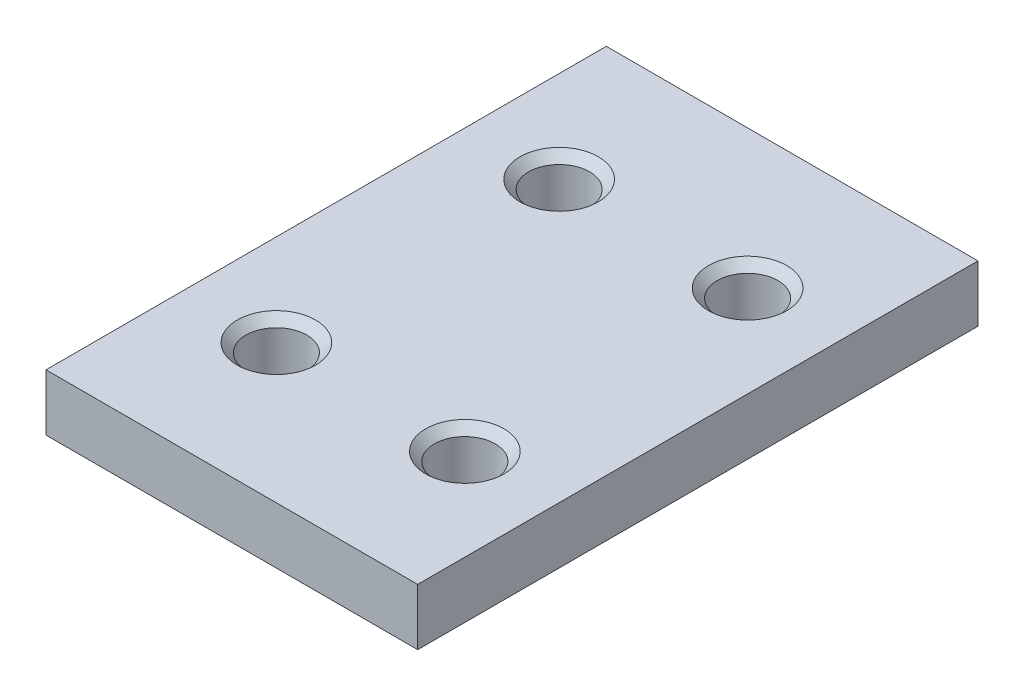
ISO-10303-21;
HEADER;
FILE_DESCRIPTION(('STEP AP214'),'2;1');
FILE_NAME('part.step','',(''),(''),'','','');
FILE_SCHEMA(('AUTOMOTIVE_DESIGN { 1 0 10303 214 1 1 1 1 }'));
ENDSEC;
DATA;
#1=APPLICATION_CONTEXT('core data for automotive mechanical design processes');
#2=APPLICATION_PROTOCOL_DEFINITION('international standard','automotive_design',2000,#1);
#3=PRODUCT_CONTEXT('',#1,'mechanical');
#4=PRODUCT('Part','Part','',(#3));
#5=PRODUCT_RELATED_PRODUCT_CATEGORY('part','',(#4));
#6=PRODUCT_DEFINITION_FORMATION('','',#4);
#7=PRODUCT_DEFINITION_CONTEXT('part definition',#1,'design');
#8=PRODUCT_DEFINITION('design','',#6,#7);
#9=PRODUCT_DEFINITION_SHAPE('','',#8);
#10=(LENGTH_UNIT() NAMED_UNIT(*) SI_UNIT(.MILLI.,.METRE.));
#11=(NAMED_UNIT(*) PLANE_ANGLE_UNIT() SI_UNIT($,.RADIAN.));
#12=(NAMED_UNIT(*) SI_UNIT($,.STERADIAN.) SOLID_ANGLE_UNIT());
#13=UNCERTAINTY_MEASURE_WITH_UNIT(LENGTH_MEASURE(1.E-05),#10,'distance_accuracy_value','');
#14=(GEOMETRIC_REPRESENTATION_CONTEXT(3) GLOBAL_UNCERTAINTY_ASSIGNED_CONTEXT((#13)) GLOBAL_UNIT_ASSIGNED_CONTEXT((#10,
#11,#12)) REPRESENTATION_CONTEXT('',''));
#15=CARTESIAN_POINT('',(0.,0.,0.));
#16=DIRECTION('',(0.,0.,1.));
#17=DIRECTION('',(1.,0.,0.));
#18=AXIS2_PLACEMENT_3D('',#15,#16,#17);
#19=CARTESIAN_POINT('',(0.,6.5,0.));
#20=DIRECTION('',(0.,-1.,0.));
#21=DIRECTION('',(0.,0.,-1.));
#22=AXIS2_PLACEMENT_3D('',#19,#20,#21);
#23=PLANE('',#22);
#24=CARTESIAN_POINT('',(-10.530066675,6.5,48.45));
#25=DIRECTION('',(0.,-1.,0.));
#26=DIRECTION('',(0.,0.,-1.));
#27=AXIS2_PLACEMENT_3D('',#24,#25,#26);
#28=CIRCLE('',#27,4.50000000000004);
#29=CARTESIAN_POINT('',(-10.530066675,6.5,43.95));
#30=VERTEX_POINT('',#29);
#31=EDGE_CURVE('E161',#30,#30,#28,.T.);
#32=ORIENTED_EDGE('',*,*,#31,.T.);
#33=EDGE_LOOP('',(#32));
#34=FACE_BOUND('',#33,.T.);
#35=CARTESIAN_POINT('',(-32.190200025,6.5,48.45));
#36=DIRECTION('',(0.,-1.,0.));
#37=DIRECTION('',(0.,0.,-1.));
#38=AXIS2_PLACEMENT_3D('',#35,#36,#37);
#39=CIRCLE('',#38,4.49999999999998);
#40=CARTESIAN_POINT('',(-32.190200025,6.5,43.95));
#41=VERTEX_POINT('',#40);
#42=EDGE_CURVE('E157',#41,#41,#39,.T.);
#43=ORIENTED_EDGE('',*,*,#42,.T.);
#44=EDGE_LOOP('',(#43));
#45=FACE_BOUND('',#44,.T.);
#46=CARTESIAN_POINT('',(-10.530066675,6.5,15.95));
#47=DIRECTION('',(0.,-1.,0.));
#48=DIRECTION('',(0.,0.,-1.));
#49=AXIS2_PLACEMENT_3D('',#46,#47,#48);
#50=CIRCLE('',#49,4.49999999999994);
#51=CARTESIAN_POINT('',(-10.530066675,6.5,11.4500000000001));
#52=VERTEX_POINT('',#51);
#53=EDGE_CURVE('E153',#52,#52,#50,.T.);
#54=ORIENTED_EDGE('',*,*,#53,.T.);
#55=EDGE_LOOP('',(#54));
#56=FACE_BOUND('',#55,.T.);
#57=CARTESIAN_POINT('',(-32.190200025,6.5,15.95));
#58=DIRECTION('',(0.,-1.,0.));
#59=DIRECTION('',(0.,0.,-1.));
#60=AXIS2_PLACEMENT_3D('',#57,#58,#59);
#61=CIRCLE('',#60,4.50000000000002);
#62=CARTESIAN_POINT('',(-32.190200025,6.5,11.45));
#63=VERTEX_POINT('',#62);
#64=EDGE_CURVE('E149',#63,#63,#61,.T.);
#65=ORIENTED_EDGE('',*,*,#64,.T.);
#66=EDGE_LOOP('',(#65));
#67=FACE_BOUND('',#66,.T.);
#68=DIRECTION('',(0.,0.,-1.));
#69=VECTOR('',#68,1.);
#70=CARTESIAN_POINT('',(0.,6.5,0.));
#71=LINE('',#70,#69);
#72=CARTESIAN_POINT('',(0.,6.5,64.4));
#73=VERTEX_POINT('',#72);
#74=CARTESIAN_POINT('',(0.,6.5,0.));
#75=VERTEX_POINT('',#74);
#76=EDGE_CURVE('E109',#73,#75,#71,.T.);
#77=ORIENTED_EDGE('',*,*,#76,.T.);
#78=DIRECTION('',(-1.,0.,0.));
#79=VECTOR('',#78,1.);
#80=CARTESIAN_POINT('',(0.,6.5,0.));
#81=LINE('',#80,#79);
#82=CARTESIAN_POINT('',(-42.7202667,6.5,0.));
#83=VERTEX_POINT('',#82);
#84=EDGE_CURVE('E105',#75,#83,#81,.T.);
#85=ORIENTED_EDGE('',*,*,#84,.T.);
#86=DIRECTION('',(0.,0.,1.));
#87=VECTOR('',#86,1.);
#88=CARTESIAN_POINT('',(-42.7202667,6.5,0.));
#89=LINE('',#88,#87);
#90=CARTESIAN_POINT('',(-42.7202667,6.5,64.4));
#91=VERTEX_POINT('',#90);
#92=EDGE_CURVE('E107',#83,#91,#89,.T.);
#93=ORIENTED_EDGE('',*,*,#92,.T.);
#94=DIRECTION('',(1.,0.,0.));
#95=VECTOR('',#94,1.);
#96=CARTESIAN_POINT('',(0.,6.5,64.4));
#97=LINE('',#96,#95);
#98=EDGE_CURVE('E74',#91,#73,#97,.T.);
#99=ORIENTED_EDGE('',*,*,#98,.T.);
#100=EDGE_LOOP('',(#77,#85,#93,#99));
#101=FACE_BOUND('',#100,.T.);
#102=ADVANCED_FACE('F55',(#34,#45,#56,#67,#101),#23,.F.);
#103=CARTESIAN_POINT('',(0.,0.,0.));
#104=DIRECTION('',(0.,-1.,0.));
#105=DIRECTION('',(0.,0.,-1.));
#106=AXIS2_PLACEMENT_3D('',#103,#104,#105);
#107=PLANE('',#106);
#108=CARTESIAN_POINT('',(-32.190200025,0.,48.45));
#109=DIRECTION('',(0.,1.,0.));
#110=DIRECTION('',(0.,0.,1.));
#111=AXIS2_PLACEMENT_3D('',#108,#109,#110);
#112=CIRCLE('',#111,3.5);
#113=CARTESIAN_POINT('',(-32.190200025,0.,51.95));
#114=VERTEX_POINT('',#113);
#115=EDGE_CURVE('E202',#114,#114,#112,.F.);
#116=ORIENTED_EDGE('',*,*,#115,.F.);
#117=EDGE_LOOP('',(#116));
#118=FACE_BOUND('',#117,.T.);
#119=CARTESIAN_POINT('',(-10.530066675,0.,15.95));
#120=DIRECTION('',(0.,1.,0.));
#121=DIRECTION('',(0.,0.,1.));
#122=AXIS2_PLACEMENT_3D('',#119,#120,#121);
#123=CIRCLE('',#122,3.5);
#124=CARTESIAN_POINT('',(-10.530066675,0.,19.45));
#125=VERTEX_POINT('',#124);
#126=EDGE_CURVE('E132',#125,#125,#123,.F.);
#127=ORIENTED_EDGE('',*,*,#126,.F.);
#128=EDGE_LOOP('',(#127));
#129=FACE_BOUND('',#128,.T.);
#130=DIRECTION('',(0.,0.,-1.));
#131=VECTOR('',#130,1.);
#132=CARTESIAN_POINT('',(0.,0.,0.));
#133=LINE('',#132,#131);
#134=CARTESIAN_POINT('',(0.,0.,64.4));
#135=VERTEX_POINT('',#134);
#136=CARTESIAN_POINT('',(0.,0.,0.));
#137=VERTEX_POINT('',#136);
#138=EDGE_CURVE('E128',#135,#137,#133,.T.);
#139=ORIENTED_EDGE('',*,*,#138,.F.);
#140=DIRECTION('',(1.,0.,0.));
#141=VECTOR('',#140,1.);
#142=CARTESIAN_POINT('',(0.,0.,64.4));
#143=LINE('',#142,#141);
#144=CARTESIAN_POINT('',(-42.7202667,0.,64.4));
#145=VERTEX_POINT('',#144);
#146=EDGE_CURVE('E97',#145,#135,#143,.T.);
#147=ORIENTED_EDGE('',*,*,#146,.F.);
#148=DIRECTION('',(0.,0.,1.));
#149=VECTOR('',#148,1.);
#150=CARTESIAN_POINT('',(-42.7202667,0.,0.));
#151=LINE('',#150,#149);
#152=CARTESIAN_POINT('',(-42.7202667,0.,0.));
#153=VERTEX_POINT('',#152);
#154=EDGE_CURVE('E91',#153,#145,#151,.T.);
#155=ORIENTED_EDGE('',*,*,#154,.F.);
#156=DIRECTION('',(-1.,0.,0.));
#157=VECTOR('',#156,1.);
#158=CARTESIAN_POINT('',(0.,0.,0.));
#159=LINE('',#158,#157);
#160=EDGE_CURVE('E115',#137,#153,#159,.T.);
#161=ORIENTED_EDGE('',*,*,#160,.F.);
#162=EDGE_LOOP('',(#139,#147,#155,#161));
#163=FACE_BOUND('',#162,.T.);
#164=CARTESIAN_POINT('',(-32.190200025,0.,15.95));
#165=DIRECTION('',(0.,1.,0.));
#166=DIRECTION('',(0.,0.,1.));
#167=AXIS2_PLACEMENT_3D('',#164,#165,#166);
#168=CIRCLE('',#167,3.5);
#169=CARTESIAN_POINT('',(-32.190200025,0.,19.45));
#170=VERTEX_POINT('',#169);
#171=EDGE_CURVE('E199',#170,#170,#168,.T.);
#172=ORIENTED_EDGE('',*,*,#171,.T.);
#173=EDGE_LOOP('',(#172));
#174=FACE_BOUND('',#173,.T.);
#175=CARTESIAN_POINT('',(-10.530066675,0.,48.45));
#176=DIRECTION('',(0.,1.,0.));
#177=DIRECTION('',(0.,0.,1.));
#178=AXIS2_PLACEMENT_3D('',#175,#176,#177);
#179=CIRCLE('',#178,3.5);
#180=CARTESIAN_POINT('',(-10.530066675,0.,51.95));
#181=VERTEX_POINT('',#180);
#182=EDGE_CURVE('E209',#181,#181,#179,.T.);
#183=ORIENTED_EDGE('',*,*,#182,.T.);
#184=EDGE_LOOP('',(#183));
#185=FACE_BOUND('',#184,.T.);
#186=ADVANCED_FACE('F183',(#118,#129,#163,#174,#185),#107,.T.);
#187=CARTESIAN_POINT('',(0.,6.5,0.));
#188=DIRECTION('',(-1.,0.,0.));
#189=DIRECTION('',(0.,0.,1.));
#190=AXIS2_PLACEMENT_3D('',#187,#188,#189);
#191=PLANE('',#190);
#192=ORIENTED_EDGE('',*,*,#138,.T.);
#193=DIRECTION('',(0.,-1.,0.));
#194=VECTOR('',#193,1.);
#195=CARTESIAN_POINT('',(0.,6.5,0.));
#196=LINE('',#195,#194);
#197=EDGE_CURVE('E117',#75,#137,#196,.T.);
#198=ORIENTED_EDGE('',*,*,#197,.F.);
#199=ORIENTED_EDGE('',*,*,#76,.F.);
#200=DIRECTION('',(0.,-1.,0.));
#201=VECTOR('',#200,1.);
#202=CARTESIAN_POINT('',(0.,6.5,64.4));
#203=LINE('',#202,#201);
#204=EDGE_CURVE('E124',#73,#135,#203,.T.);
#205=ORIENTED_EDGE('',*,*,#204,.T.);
#206=EDGE_LOOP('',(#192,#198,#199,#205));
#207=FACE_BOUND('',#206,.T.);
#208=ADVANCED_FACE('F237',(#207),#191,.F.);
#209=CARTESIAN_POINT('',(0.,6.5,0.));
#210=DIRECTION('',(0.,0.,1.));
#211=DIRECTION('',(1.,0.,0.));
#212=AXIS2_PLACEMENT_3D('',#209,#210,#211);
#213=PLANE('',#212);
#214=ORIENTED_EDGE('',*,*,#160,.T.);
#215=DIRECTION('',(0.,-1.,0.));
#216=VECTOR('',#215,1.);
#217=CARTESIAN_POINT('',(-42.7202667,6.5,0.));
#218=LINE('',#217,#216);
#219=EDGE_CURVE('E113',#83,#153,#218,.T.);
#220=ORIENTED_EDGE('',*,*,#219,.F.);
#221=ORIENTED_EDGE('',*,*,#84,.F.);
#222=ORIENTED_EDGE('',*,*,#197,.T.);
#223=EDGE_LOOP('',(#214,#220,#221,#222));
#224=FACE_BOUND('',#223,.T.);
#225=ADVANCED_FACE('F114',(#224),#213,.F.);
#226=CARTESIAN_POINT('',(-42.7202667,6.5,0.));
#227=DIRECTION('',(1.,0.,0.));
#228=DIRECTION('',(0.,0.,-1.));
#229=AXIS2_PLACEMENT_3D('',#226,#227,#228);
#230=PLANE('',#229);
#231=ORIENTED_EDGE('',*,*,#154,.T.);
#232=DIRECTION('',(0.,-1.,0.));
#233=VECTOR('',#232,1.);
#234=CARTESIAN_POINT('',(-42.7202667,6.5,64.4));
#235=LINE('',#234,#233);
#236=EDGE_CURVE('E118',#91,#145,#235,.T.);
#237=ORIENTED_EDGE('',*,*,#236,.F.);
#238=ORIENTED_EDGE('',*,*,#92,.F.);
#239=ORIENTED_EDGE('',*,*,#219,.T.);
#240=EDGE_LOOP('',(#231,#237,#238,#239));
#241=FACE_BOUND('',#240,.T.);
#242=ADVANCED_FACE('F120',(#241),#230,.F.);
#243=CARTESIAN_POINT('',(0.,6.5,64.4));
#244=DIRECTION('',(0.,0.,-1.));
#245=DIRECTION('',(-1.,0.,0.));
#246=AXIS2_PLACEMENT_3D('',#243,#244,#245);
#247=PLANE('',#246);
#248=ORIENTED_EDGE('',*,*,#146,.T.);
#249=ORIENTED_EDGE('',*,*,#204,.F.);
#250=ORIENTED_EDGE('',*,*,#98,.F.);
#251=ORIENTED_EDGE('',*,*,#236,.T.);
#252=EDGE_LOOP('',(#248,#249,#250,#251));
#253=FACE_BOUND('',#252,.T.);
#254=ADVANCED_FACE('F233',(#253),#247,.F.);
#255=CARTESIAN_POINT('',(-10.530066675,0.,15.95));
#256=DIRECTION('',(0.,1.,0.));
#257=DIRECTION('',(0.,0.,1.));
#258=AXIS2_PLACEMENT_3D('',#255,#256,#257);
#259=CYLINDRICAL_SURFACE('',#258,3.5);
#260=CARTESIAN_POINT('',(-10.530066675,5.50000000000005,15.95));
#261=DIRECTION('',(0.,-1.,0.));
#262=DIRECTION('',(0.,0.,-1.));
#263=AXIS2_PLACEMENT_3D('',#260,#261,#262);
#264=CIRCLE('',#263,3.5);
#265=CARTESIAN_POINT('',(-10.530066675,5.50000000000005,12.45));
#266=VERTEX_POINT('',#265);
#267=EDGE_CURVE('E66',#266,#266,#264,.F.);
#268=ORIENTED_EDGE('',*,*,#267,.T.);
#269=EDGE_LOOP('',(#268));
#270=FACE_BOUND('',#269,.T.);
#271=ORIENTED_EDGE('',*,*,#126,.T.);
#272=EDGE_LOOP('',(#271));
#273=FACE_BOUND('',#272,.T.);
#274=ADVANCED_FACE('F172',(#270,#273),#259,.F.);
#275=CARTESIAN_POINT('',(-32.190200025,0.,15.95));
#276=DIRECTION('',(0.,1.,0.));
#277=DIRECTION('',(0.,0.,1.));
#278=AXIS2_PLACEMENT_3D('',#275,#276,#277);
#279=CYLINDRICAL_SURFACE('',#278,3.5);
#280=CARTESIAN_POINT('',(-32.190200025,5.49999999999998,15.95));
#281=DIRECTION('',(0.,-1.,0.));
#282=DIRECTION('',(0.,0.,-1.));
#283=AXIS2_PLACEMENT_3D('',#280,#281,#282);
#284=CIRCLE('',#283,3.5);
#285=CARTESIAN_POINT('',(-32.190200025,5.49999999999998,12.45));
#286=VERTEX_POINT('',#285);
#287=EDGE_CURVE('E12',#286,#286,#284,.F.);
#288=ORIENTED_EDGE('',*,*,#287,.T.);
#289=EDGE_LOOP('',(#288));
#290=FACE_BOUND('',#289,.T.);
#291=ORIENTED_EDGE('',*,*,#171,.F.);
#292=EDGE_LOOP('',(#291));
#293=FACE_BOUND('',#292,.T.);
#294=ADVANCED_FACE('F192',(#290,#293),#279,.F.);
#295=CARTESIAN_POINT('',(-32.190200025,0.,48.45));
#296=DIRECTION('',(0.,1.,0.));
#297=DIRECTION('',(0.,0.,1.));
#298=AXIS2_PLACEMENT_3D('',#295,#296,#297);
#299=CYLINDRICAL_SURFACE('',#298,3.5);
#300=CARTESIAN_POINT('',(-32.190200025,5.50000000000002,48.45));
#301=DIRECTION('',(0.,-1.,0.));
#302=DIRECTION('',(0.,0.,-1.));
#303=AXIS2_PLACEMENT_3D('',#300,#301,#302);
#304=CIRCLE('',#303,3.5);
#305=CARTESIAN_POINT('',(-32.190200025,5.50000000000002,44.95));
#306=VERTEX_POINT('',#305);
#307=EDGE_CURVE('E165',#306,#306,#304,.F.);
#308=ORIENTED_EDGE('',*,*,#307,.T.);
#309=EDGE_LOOP('',(#308));
#310=FACE_BOUND('',#309,.T.);
#311=ORIENTED_EDGE('',*,*,#115,.T.);
#312=EDGE_LOOP('',(#311));
#313=FACE_BOUND('',#312,.T.);
#314=ADVANCED_FACE('F195',(#310,#313),#299,.F.);
#315=CARTESIAN_POINT('',(-10.530066675,0.,48.45));
#316=DIRECTION('',(0.,1.,0.));
#317=DIRECTION('',(0.,0.,1.));
#318=AXIS2_PLACEMENT_3D('',#315,#316,#317);
#319=CYLINDRICAL_SURFACE('',#318,3.5);
#320=CARTESIAN_POINT('',(-10.530066675,5.49999999999996,48.45));
#321=DIRECTION('',(0.,-1.,0.));
#322=DIRECTION('',(0.,0.,-1.));
#323=AXIS2_PLACEMENT_3D('',#320,#321,#322);
#324=CIRCLE('',#323,3.5);
#325=CARTESIAN_POINT('',(-10.530066675,5.49999999999996,44.95));
#326=VERTEX_POINT('',#325);
#327=EDGE_CURVE('E145',#326,#326,#324,.F.);
#328=ORIENTED_EDGE('',*,*,#327,.T.);
#329=EDGE_LOOP('',(#328));
#330=FACE_BOUND('',#329,.T.);
#331=ORIENTED_EDGE('',*,*,#182,.F.);
#332=EDGE_LOOP('',(#331));
#333=FACE_BOUND('',#332,.T.);
#334=ADVANCED_FACE('F218',(#330,#333),#319,.F.);
#335=CARTESIAN_POINT('',(-10.530066675,5.49999999999996,48.45));
#336=DIRECTION('',(0.,1.,0.));
#337=DIRECTION('',(0.,0.,1.));
#338=AXIS2_PLACEMENT_3D('',#335,#336,#337);
#339=CONICAL_SURFACE('',#338,3.5,0.785398163397446);
#340=ORIENTED_EDGE('',*,*,#31,.F.);
#341=EDGE_LOOP('',(#340));
#342=FACE_BOUND('',#341,.T.);
#343=ORIENTED_EDGE('',*,*,#327,.F.);
#344=EDGE_LOOP('',(#343));
#345=FACE_BOUND('',#344,.T.);
#346=ADVANCED_FACE('F220',(#342,#345),#339,.F.);
#347=CARTESIAN_POINT('',(-32.190200025,6.5,48.45));
#348=DIRECTION('',(0.,1.,0.));
#349=DIRECTION('',(0.,0.,1.));
#350=AXIS2_PLACEMENT_3D('',#347,#348,#349);
#351=CONICAL_SURFACE('',#350,4.49999999999998,0.785398163397446);
#352=ORIENTED_EDGE('',*,*,#307,.F.);
#353=EDGE_LOOP('',(#352));
#354=FACE_BOUND('',#353,.T.);
#355=ORIENTED_EDGE('',*,*,#42,.F.);
#356=EDGE_LOOP('',(#355));
#357=FACE_BOUND('',#356,.T.);
#358=ADVANCED_FACE('F178',(#354,#357),#351,.F.);
#359=CARTESIAN_POINT('',(-10.530066675,6.5,15.95));
#360=DIRECTION('',(0.,1.,0.));
#361=DIRECTION('',(0.,0.,1.));
#362=AXIS2_PLACEMENT_3D('',#359,#360,#361);
#363=CONICAL_SURFACE('',#362,4.49999999999994,0.785398163397445);
#364=ORIENTED_EDGE('',*,*,#267,.F.);
#365=EDGE_LOOP('',(#364));
#366=FACE_BOUND('',#365,.T.);
#367=ORIENTED_EDGE('',*,*,#53,.F.);
#368=EDGE_LOOP('',(#367));
#369=FACE_BOUND('',#368,.T.);
#370=ADVANCED_FACE('F175',(#366,#369),#363,.F.);
#371=CARTESIAN_POINT('',(-32.190200025,5.49999999999998,15.95));
#372=DIRECTION('',(0.,1.,0.));
#373=DIRECTION('',(0.,0.,1.));
#374=AXIS2_PLACEMENT_3D('',#371,#372,#373);
#375=CONICAL_SURFACE('',#374,3.5,0.785398163397449);
#376=ORIENTED_EDGE('',*,*,#64,.F.);
#377=EDGE_LOOP('',(#376));
#378=FACE_BOUND('',#377,.T.);
#379=ORIENTED_EDGE('',*,*,#287,.F.);
#380=EDGE_LOOP('',(#379));
#381=FACE_BOUND('',#380,.T.);
#382=ADVANCED_FACE('F58',(#378,#381),#375,.F.);
#383=CLOSED_SHELL('',(#102,#186,#208,#225,#242,#254,#274,#294,#314,#334,#346,#358,#370,#382));
#384=MANIFOLD_SOLID_BREP('B2',#383);
#385=ADVANCED_BREP_SHAPE_REPRESENTATION('',(#18,#384),#14);
#386=SHAPE_DEFINITION_REPRESENTATION(#9,#385);
ENDSEC;
END-ISO-10303-21;
